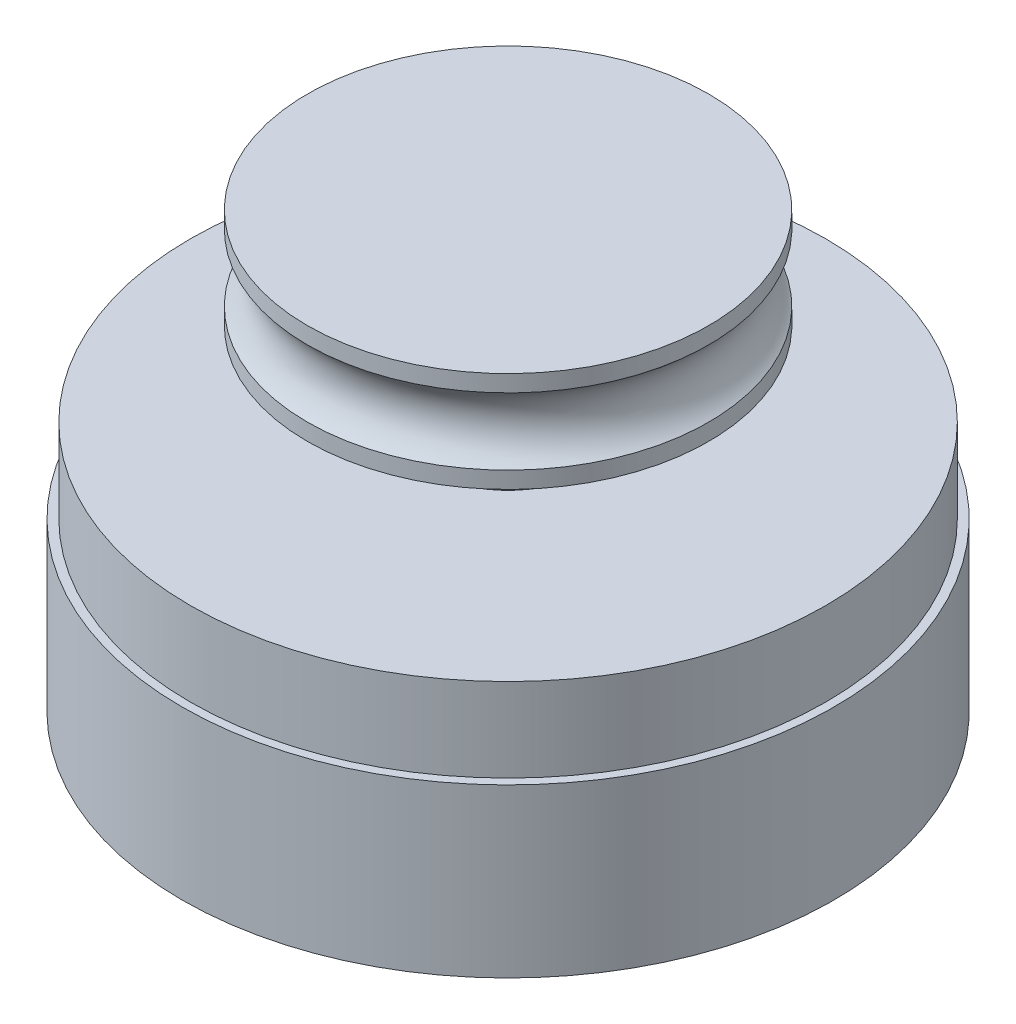
ISO-10303-21;
HEADER;
FILE_DESCRIPTION(('STEP AP214'),'2;1');
FILE_NAME('part.step','',(''),(''),'','','');
FILE_SCHEMA(('AUTOMOTIVE_DESIGN { 1 0 10303 214 1 1 1 1 }'));
ENDSEC;
DATA;
#1=APPLICATION_CONTEXT('core data for automotive mechanical design processes');
#2=APPLICATION_PROTOCOL_DEFINITION('international standard','automotive_design',2000,#1);
#3=PRODUCT_CONTEXT('',#1,'mechanical');
#4=PRODUCT('Part','Part','',(#3));
#5=PRODUCT_RELATED_PRODUCT_CATEGORY('part','',(#4));
#6=PRODUCT_DEFINITION_FORMATION('','',#4);
#7=PRODUCT_DEFINITION_CONTEXT('part definition',#1,'design');
#8=PRODUCT_DEFINITION('design','',#6,#7);
#9=PRODUCT_DEFINITION_SHAPE('','',#8);
#10=(LENGTH_UNIT() NAMED_UNIT(*) SI_UNIT(.MILLI.,.METRE.));
#11=(NAMED_UNIT(*) PLANE_ANGLE_UNIT() SI_UNIT($,.RADIAN.));
#12=(NAMED_UNIT(*) SI_UNIT($,.STERADIAN.) SOLID_ANGLE_UNIT());
#13=UNCERTAINTY_MEASURE_WITH_UNIT(LENGTH_MEASURE(1.E-05),#10,'distance_accuracy_value','');
#14=(GEOMETRIC_REPRESENTATION_CONTEXT(3) GLOBAL_UNCERTAINTY_ASSIGNED_CONTEXT((#13)) GLOBAL_UNIT_ASSIGNED_CONTEXT((#10,
#11,#12)) REPRESENTATION_CONTEXT('',''));
#15=CARTESIAN_POINT('',(0.,0.,0.));
#16=DIRECTION('',(0.,0.,1.));
#17=DIRECTION('',(1.,0.,0.));
#18=AXIS2_PLACEMENT_3D('',#15,#16,#17);
#19=CARTESIAN_POINT('',(0.,10.,0.));
#20=DIRECTION('',(0.,-1.,0.));
#21=DIRECTION('',(0.,0.,-1.));
#22=AXIS2_PLACEMENT_3D('',#19,#20,#21);
#23=CYLINDRICAL_SURFACE('',#22,19.5);
#24=CARTESIAN_POINT('',(0.,10.,0.));
#25=DIRECTION('',(0.,1.,0.));
#26=DIRECTION('',(0.,0.,1.));
#27=AXIS2_PLACEMENT_3D('',#24,#25,#26);
#28=CIRCLE('',#27,19.5);
#29=CARTESIAN_POINT('',(0.,10.,19.5));
#30=VERTEX_POINT('',#29);
#31=EDGE_CURVE('E47',#30,#30,#28,.T.);
#32=ORIENTED_EDGE('',*,*,#31,.F.);
#33=EDGE_LOOP('',(#32));
#34=FACE_BOUND('',#33,.T.);
#35=CARTESIAN_POINT('',(0.,0.,0.));
#36=DIRECTION('',(0.,1.,0.));
#37=DIRECTION('',(0.,0.,1.));
#38=AXIS2_PLACEMENT_3D('',#35,#36,#37);
#39=CIRCLE('',#38,19.5);
#40=CARTESIAN_POINT('',(0.,0.,19.5));
#41=VERTEX_POINT('',#40);
#42=EDGE_CURVE('E38',#41,#41,#39,.T.);
#43=ORIENTED_EDGE('',*,*,#42,.T.);
#44=EDGE_LOOP('',(#43));
#45=FACE_BOUND('',#44,.T.);
#46=ADVANCED_FACE('F35',(#34,#45),#23,.T.);
#47=CARTESIAN_POINT('',(0.,10.,0.));
#48=DIRECTION('',(0.,1.,0.));
#49=DIRECTION('',(0.,0.,1.));
#50=AXIS2_PLACEMENT_3D('',#47,#48,#49);
#51=PLANE('',#50);
#52=CARTESIAN_POINT('',(0.,10.,0.));
#53=DIRECTION('',(0.,1.,0.));
#54=DIRECTION('',(0.,0.,1.));
#55=AXIS2_PLACEMENT_3D('',#52,#53,#54);
#56=CIRCLE('',#55,19.);
#57=CARTESIAN_POINT('',(0.,10.,19.));
#58=VERTEX_POINT('',#57);
#59=EDGE_CURVE('E42',#58,#58,#56,.T.);
#60=ORIENTED_EDGE('',*,*,#59,.F.);
#61=EDGE_LOOP('',(#60));
#62=FACE_BOUND('',#61,.T.);
#63=ORIENTED_EDGE('',*,*,#31,.T.);
#64=EDGE_LOOP('',(#63));
#65=FACE_BOUND('',#64,.T.);
#66=ADVANCED_FACE('F65',(#62,#65),#51,.T.);
#67=CARTESIAN_POINT('',(0.,0.,0.));
#68=DIRECTION('',(0.,1.,0.));
#69=DIRECTION('',(0.,0.,1.));
#70=AXIS2_PLACEMENT_3D('',#67,#68,#69);
#71=PLANE('',#70);
#72=ORIENTED_EDGE('',*,*,#42,.F.);
#73=EDGE_LOOP('',(#72));
#74=FACE_BOUND('',#73,.T.);
#75=ADVANCED_FACE('F62',(#74),#71,.F.);
#76=CARTESIAN_POINT('',(0.,15.,0.));
#77=DIRECTION('',(0.,-1.,0.));
#78=DIRECTION('',(0.,0.,-1.));
#79=AXIS2_PLACEMENT_3D('',#76,#77,#78);
#80=CYLINDRICAL_SURFACE('',#79,19.);
#81=CARTESIAN_POINT('',(0.,15.,0.));
#82=DIRECTION('',(0.,1.,0.));
#83=DIRECTION('',(0.,0.,1.));
#84=AXIS2_PLACEMENT_3D('',#81,#82,#83);
#85=CIRCLE('',#84,19.);
#86=CARTESIAN_POINT('',(0.,15.,19.));
#87=VERTEX_POINT('',#86);
#88=EDGE_CURVE('E53',#87,#87,#85,.T.);
#89=ORIENTED_EDGE('',*,*,#88,.F.);
#90=EDGE_LOOP('',(#89));
#91=FACE_BOUND('',#90,.T.);
#92=ORIENTED_EDGE('',*,*,#59,.T.);
#93=EDGE_LOOP('',(#92));
#94=FACE_BOUND('',#93,.T.);
#95=ADVANCED_FACE('F64',(#91,#94),#80,.T.);
#96=CARTESIAN_POINT('',(0.,15.,0.));
#97=DIRECTION('',(0.,1.,0.));
#98=DIRECTION('',(0.,0.,1.));
#99=AXIS2_PLACEMENT_3D('',#96,#97,#98);
#100=PLANE('',#99);
#101=CARTESIAN_POINT('',(0.,15.,0.));
#102=DIRECTION('',(0.,1.,0.));
#103=DIRECTION('',(0.,0.,1.));
#104=AXIS2_PLACEMENT_3D('',#101,#102,#103);
#105=CIRCLE('',#104,5.);
#106=CARTESIAN_POINT('',(0.,15.,5.));
#107=VERTEX_POINT('',#106);
#108=EDGE_CURVE('E10',#107,#107,#105,.T.);
#109=ORIENTED_EDGE('',*,*,#108,.F.);
#110=EDGE_LOOP('',(#109));
#111=FACE_BOUND('',#110,.T.);
#112=ORIENTED_EDGE('',*,*,#88,.T.);
#113=EDGE_LOOP('',(#112));
#114=FACE_BOUND('',#113,.T.);
#115=ADVANCED_FACE('F70',(#111,#114),#100,.T.);
#116=CARTESIAN_POINT('',(0.,20.,0.));
#117=DIRECTION('',(0.,-1.,0.));
#118=DIRECTION('',(0.,0.,-1.));
#119=AXIS2_PLACEMENT_3D('',#116,#117,#118);
#120=CYLINDRICAL_SURFACE('',#119,5.);
#121=CARTESIAN_POINT('',(0.,20.,0.));
#122=DIRECTION('',(0.,1.,0.));
#123=DIRECTION('',(0.,0.,1.));
#124=AXIS2_PLACEMENT_3D('',#121,#122,#123);
#125=CIRCLE('',#124,5.);
#126=CARTESIAN_POINT('',(0.,20.,5.));
#127=VERTEX_POINT('',#126);
#128=EDGE_CURVE('E51',#127,#127,#125,.T.);
#129=ORIENTED_EDGE('',*,*,#128,.F.);
#130=EDGE_LOOP('',(#129));
#131=FACE_BOUND('',#130,.T.);
#132=ORIENTED_EDGE('',*,*,#108,.T.);
#133=EDGE_LOOP('',(#132));
#134=FACE_BOUND('',#133,.T.);
#135=ADVANCED_FACE('F101',(#131,#134),#120,.T.);
#136=CARTESIAN_POINT('',(12.,20.,0.));
#137=DIRECTION('',(0.,-1.,0.));
#138=DIRECTION('',(0.,0.,-1.));
#139=AXIS2_PLACEMENT_3D('',#136,#137,#138);
#140=PLANE('',#139);
#141=ORIENTED_EDGE('',*,*,#128,.T.);
#142=EDGE_LOOP('',(#141));
#143=FACE_BOUND('',#142,.T.);
#144=CARTESIAN_POINT('',(0.,20.,0.));
#145=DIRECTION('',(0.,-1.,0.));
#146=DIRECTION('',(0.,0.,-1.));
#147=AXIS2_PLACEMENT_3D('',#144,#145,#146);
#148=CIRCLE('',#147,12.);
#149=CARTESIAN_POINT('',(0.,20.,-12.));
#150=VERTEX_POINT('',#149);
#151=EDGE_CURVE('E171',#150,#150,#148,.T.);
#152=ORIENTED_EDGE('',*,*,#151,.T.);
#153=EDGE_LOOP('',(#152));
#154=FACE_BOUND('',#153,.T.);
#155=ADVANCED_FACE('F111',(#143,#154),#140,.T.);
#156=CARTESIAN_POINT('',(0.,26.,0.));
#157=DIRECTION('',(0.,1.,0.));
#158=DIRECTION('',(0.,0.,1.));
#159=AXIS2_PLACEMENT_3D('',#156,#157,#158);
#160=PLANE('',#159);
#161=CARTESIAN_POINT('',(0.,26.,0.));
#162=DIRECTION('',(0.,-1.,0.));
#163=DIRECTION('',(0.,0.,-1.));
#164=AXIS2_PLACEMENT_3D('',#161,#162,#163);
#165=CIRCLE('',#164,12.);
#166=CARTESIAN_POINT('',(0.,26.,-12.));
#167=VERTEX_POINT('',#166);
#168=EDGE_CURVE('E178',#167,#167,#165,.T.);
#169=ORIENTED_EDGE('',*,*,#168,.F.);
#170=EDGE_LOOP('',(#169));
#171=FACE_BOUND('',#170,.T.);
#172=ADVANCED_FACE('F121',(#171),#160,.T.);
#173=CARTESIAN_POINT('',(0.,20.,0.));
#174=DIRECTION('',(0.,-1.,0.));
#175=DIRECTION('',(0.,0.,-1.));
#176=AXIS2_PLACEMENT_3D('',#173,#174,#175);
#177=CYLINDRICAL_SURFACE('',#176,12.);
#178=ORIENTED_EDGE('',*,*,#168,.T.);
#179=EDGE_LOOP('',(#178));
#180=FACE_BOUND('',#179,.T.);
#181=CARTESIAN_POINT('',(0.,25.,0.));
#182=DIRECTION('',(0.,-1.,0.));
#183=DIRECTION('',(0.,0.,-1.));
#184=AXIS2_PLACEMENT_3D('',#181,#182,#183);
#185=CIRCLE('',#184,12.);
#186=CARTESIAN_POINT('',(0.,25.,-12.));
#187=VERTEX_POINT('',#186);
#188=EDGE_CURVE('E174',#187,#187,#185,.T.);
#189=ORIENTED_EDGE('',*,*,#188,.F.);
#190=EDGE_LOOP('',(#189));
#191=FACE_BOUND('',#190,.T.);
#192=ADVANCED_FACE('F131',(#180,#191),#177,.T.);
#193=CARTESIAN_POINT('',(0.,23.,0.));
#194=DIRECTION('',(0.,-1.,0.));
#195=DIRECTION('',(0.,0.,-1.));
#196=AXIS2_PLACEMENT_3D('',#193,#194,#195);
#197=TOROIDAL_SURFACE('',#196,13.5,2.5);
#198=ORIENTED_EDGE('',*,*,#188,.T.);
#199=EDGE_LOOP('',(#198));
#200=FACE_BOUND('',#199,.T.);
#201=CARTESIAN_POINT('',(0.,21.,0.));
#202=DIRECTION('',(0.,-1.,0.));
#203=DIRECTION('',(0.,0.,-1.));
#204=AXIS2_PLACEMENT_3D('',#201,#202,#203);
#205=CIRCLE('',#204,12.);
#206=CARTESIAN_POINT('',(0.,21.,-12.));
#207=VERTEX_POINT('',#206);
#208=EDGE_CURVE('E168',#207,#207,#205,.T.);
#209=ORIENTED_EDGE('',*,*,#208,.F.);
#210=EDGE_LOOP('',(#209));
#211=FACE_BOUND('',#210,.T.);
#212=ADVANCED_FACE('F141',(#200,#211),#197,.F.);
#213=CARTESIAN_POINT('',(0.,20.,0.));
#214=DIRECTION('',(0.,-1.,0.));
#215=DIRECTION('',(0.,0.,-1.));
#216=AXIS2_PLACEMENT_3D('',#213,#214,#215);
#217=CYLINDRICAL_SURFACE('',#216,12.);
#218=ORIENTED_EDGE('',*,*,#208,.T.);
#219=EDGE_LOOP('',(#218));
#220=FACE_BOUND('',#219,.T.);
#221=ORIENTED_EDGE('',*,*,#151,.F.);
#222=EDGE_LOOP('',(#221));
#223=FACE_BOUND('',#222,.T.);
#224=ADVANCED_FACE('F151',(#220,#223),#217,.T.);
#225=CLOSED_SHELL('',(#46,#66,#75,#95,#115,#135,#155,#172,#192,#212,#224));
#226=MANIFOLD_SOLID_BREP('B2',#225);
#227=ADVANCED_BREP_SHAPE_REPRESENTATION('',(#18,#226),#14);
#228=SHAPE_DEFINITION_REPRESENTATION(#9,#227);
ENDSEC;
END-ISO-10303-21;
